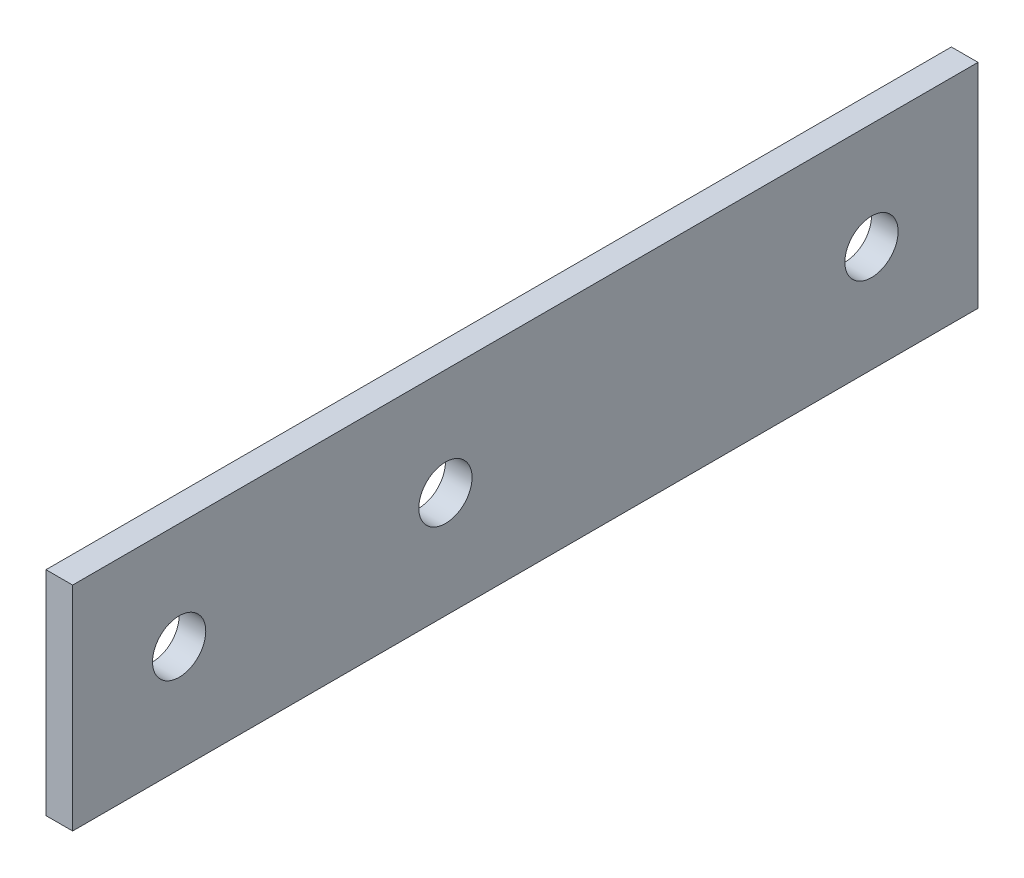
ISO-10303-21;
HEADER;
FILE_DESCRIPTION(('STEP AP214'),'2;1');
FILE_NAME('part.step','',(''),(''),'','','');
FILE_SCHEMA(('AUTOMOTIVE_DESIGN { 1 0 10303 214 1 1 1 1 }'));
ENDSEC;
DATA;
#1=APPLICATION_CONTEXT('core data for automotive mechanical design processes');
#2=APPLICATION_PROTOCOL_DEFINITION('international standard','automotive_design',2000,#1);
#3=PRODUCT_CONTEXT('',#1,'mechanical');
#4=PRODUCT('Part','Part','',(#3));
#5=PRODUCT_RELATED_PRODUCT_CATEGORY('part','',(#4));
#6=PRODUCT_DEFINITION_FORMATION('','',#4);
#7=PRODUCT_DEFINITION_CONTEXT('part definition',#1,'design');
#8=PRODUCT_DEFINITION('design','',#6,#7);
#9=PRODUCT_DEFINITION_SHAPE('','',#8);
#10=(LENGTH_UNIT() NAMED_UNIT(*) SI_UNIT(.MILLI.,.METRE.));
#11=(NAMED_UNIT(*) PLANE_ANGLE_UNIT() SI_UNIT($,.RADIAN.));
#12=(NAMED_UNIT(*) SI_UNIT($,.STERADIAN.) SOLID_ANGLE_UNIT());
#13=UNCERTAINTY_MEASURE_WITH_UNIT(LENGTH_MEASURE(1.E-05),#10,'distance_accuracy_value','');
#14=(GEOMETRIC_REPRESENTATION_CONTEXT(3) GLOBAL_UNCERTAINTY_ASSIGNED_CONTEXT((#13)) GLOBAL_UNIT_ASSIGNED_CONTEXT((#10,
#11,#12)) REPRESENTATION_CONTEXT('',''));
#15=CARTESIAN_POINT('',(0.,0.,0.));
#16=DIRECTION('',(0.,0.,1.));
#17=DIRECTION('',(1.,0.,0.));
#18=AXIS2_PLACEMENT_3D('',#15,#16,#17);
#19=CARTESIAN_POINT('',(3.175,-12.7,53.975));
#20=DIRECTION('',(0.,0.,-1.));
#21=DIRECTION('',(-1.,0.,0.));
#22=AXIS2_PLACEMENT_3D('',#19,#20,#21);
#23=PLANE('',#22);
#24=DIRECTION('',(0.,-1.,0.));
#25=VECTOR('',#24,1.);
#26=CARTESIAN_POINT('',(0.,-12.7,53.975));
#27=LINE('',#26,#25);
#28=CARTESIAN_POINT('',(0.,12.7,53.975));
#29=VERTEX_POINT('',#28);
#30=CARTESIAN_POINT('',(0.,-12.7,53.975));
#31=VERTEX_POINT('',#30);
#32=EDGE_CURVE('E96',#29,#31,#27,.T.);
#33=ORIENTED_EDGE('',*,*,#32,.T.);
#34=DIRECTION('',(-1.,0.,0.));
#35=VECTOR('',#34,1.);
#36=CARTESIAN_POINT('',(3.175,-12.7,53.975));
#37=LINE('',#36,#35);
#38=CARTESIAN_POINT('',(3.175,-12.7,53.975));
#39=VERTEX_POINT('',#38);
#40=EDGE_CURVE('E11',#39,#31,#37,.T.);
#41=ORIENTED_EDGE('',*,*,#40,.F.);
#42=DIRECTION('',(0.,-1.,0.));
#43=VECTOR('',#42,1.);
#44=CARTESIAN_POINT('',(3.175,-12.7,53.975));
#45=LINE('',#44,#43);
#46=CARTESIAN_POINT('',(3.175,12.7,53.975));
#47=VERTEX_POINT('',#46);
#48=EDGE_CURVE('E84',#47,#39,#45,.T.);
#49=ORIENTED_EDGE('',*,*,#48,.F.);
#50=DIRECTION('',(-1.,0.,0.));
#51=VECTOR('',#50,1.);
#52=CARTESIAN_POINT('',(3.175,12.7,53.975));
#53=LINE('',#52,#51);
#54=EDGE_CURVE('E92',#47,#29,#53,.T.);
#55=ORIENTED_EDGE('',*,*,#54,.T.);
#56=EDGE_LOOP('',(#33,#41,#49,#55));
#57=FACE_BOUND('',#56,.T.);
#58=ADVANCED_FACE('F33',(#57),#23,.F.);
#59=CARTESIAN_POINT('',(3.175,-12.7,-53.975));
#60=DIRECTION('',(0.,1.,0.));
#61=DIRECTION('',(0.,0.,1.));
#62=AXIS2_PLACEMENT_3D('',#59,#60,#61);
#63=PLANE('',#62);
#64=DIRECTION('',(0.,0.,-1.));
#65=VECTOR('',#64,1.);
#66=CARTESIAN_POINT('',(0.,-12.7,-53.975));
#67=LINE('',#66,#65);
#68=CARTESIAN_POINT('',(0.,-12.7,-53.975));
#69=VERTEX_POINT('',#68);
#70=EDGE_CURVE('E88',#31,#69,#67,.T.);
#71=ORIENTED_EDGE('',*,*,#70,.T.);
#72=DIRECTION('',(-1.,0.,0.));
#73=VECTOR('',#72,1.);
#74=CARTESIAN_POINT('',(3.175,-12.7,-53.975));
#75=LINE('',#74,#73);
#76=CARTESIAN_POINT('',(3.175,-12.7,-53.975));
#77=VERTEX_POINT('',#76);
#78=EDGE_CURVE('E41',#77,#69,#75,.T.);
#79=ORIENTED_EDGE('',*,*,#78,.F.);
#80=DIRECTION('',(0.,0.,-1.));
#81=VECTOR('',#80,1.);
#82=CARTESIAN_POINT('',(3.175,-12.7,-53.975));
#83=LINE('',#82,#81);
#84=EDGE_CURVE('E79',#39,#77,#83,.T.);
#85=ORIENTED_EDGE('',*,*,#84,.F.);
#86=ORIENTED_EDGE('',*,*,#40,.T.);
#87=EDGE_LOOP('',(#71,#79,#85,#86));
#88=FACE_BOUND('',#87,.T.);
#89=ADVANCED_FACE('F87',(#88),#63,.F.);
#90=CARTESIAN_POINT('',(3.175,-12.7,-53.975));
#91=DIRECTION('',(0.,0.,1.));
#92=DIRECTION('',(1.,0.,0.));
#93=AXIS2_PLACEMENT_3D('',#90,#91,#92);
#94=PLANE('',#93);
#95=DIRECTION('',(0.,1.,0.));
#96=VECTOR('',#95,1.);
#97=CARTESIAN_POINT('',(0.,-12.7,-53.975));
#98=LINE('',#97,#96);
#99=CARTESIAN_POINT('',(0.,12.7,-53.975));
#100=VERTEX_POINT('',#99);
#101=EDGE_CURVE('E66',#69,#100,#98,.T.);
#102=ORIENTED_EDGE('',*,*,#101,.T.);
#103=DIRECTION('',(-1.,0.,0.));
#104=VECTOR('',#103,1.);
#105=CARTESIAN_POINT('',(3.175,12.7,-53.975));
#106=LINE('',#105,#104);
#107=CARTESIAN_POINT('',(3.175,12.7,-53.975));
#108=VERTEX_POINT('',#107);
#109=EDGE_CURVE('E89',#108,#100,#106,.T.);
#110=ORIENTED_EDGE('',*,*,#109,.F.);
#111=DIRECTION('',(0.,1.,0.));
#112=VECTOR('',#111,1.);
#113=CARTESIAN_POINT('',(3.175,-12.7,-53.975));
#114=LINE('',#113,#112);
#115=EDGE_CURVE('E82',#77,#108,#114,.T.);
#116=ORIENTED_EDGE('',*,*,#115,.F.);
#117=ORIENTED_EDGE('',*,*,#78,.T.);
#118=EDGE_LOOP('',(#102,#110,#116,#117));
#119=FACE_BOUND('',#118,.T.);
#120=ADVANCED_FACE('F90',(#119),#94,.F.);
#121=CARTESIAN_POINT('',(3.175,12.7,-53.975));
#122=DIRECTION('',(0.,-1.,0.));
#123=DIRECTION('',(0.,0.,-1.));
#124=AXIS2_PLACEMENT_3D('',#121,#122,#123);
#125=PLANE('',#124);
#126=DIRECTION('',(0.,0.,1.));
#127=VECTOR('',#126,1.);
#128=CARTESIAN_POINT('',(0.,12.7,-53.975));
#129=LINE('',#128,#127);
#130=EDGE_CURVE('E72',#100,#29,#129,.T.);
#131=ORIENTED_EDGE('',*,*,#130,.T.);
#132=ORIENTED_EDGE('',*,*,#54,.F.);
#133=DIRECTION('',(0.,0.,1.));
#134=VECTOR('',#133,1.);
#135=CARTESIAN_POINT('',(3.175,12.7,-53.975));
#136=LINE('',#135,#134);
#137=EDGE_CURVE('E49',#108,#47,#136,.T.);
#138=ORIENTED_EDGE('',*,*,#137,.F.);
#139=ORIENTED_EDGE('',*,*,#109,.T.);
#140=EDGE_LOOP('',(#131,#132,#138,#139));
#141=FACE_BOUND('',#140,.T.);
#142=ADVANCED_FACE('F104',(#141),#125,.F.);
#143=CARTESIAN_POINT('',(3.175,0.,0.));
#144=DIRECTION('',(1.,0.,0.));
#145=DIRECTION('',(0.,0.,-1.));
#146=AXIS2_PLACEMENT_3D('',#143,#144,#145);
#147=PLANE('',#146);
#148=CARTESIAN_POINT('',(3.175,0.,9.52499999999999));
#149=DIRECTION('',(1.,0.,0.));
#150=DIRECTION('',(0.,0.,-1.));
#151=AXIS2_PLACEMENT_3D('',#148,#149,#150);
#152=CIRCLE('',#151,3.175);
#153=CARTESIAN_POINT('',(3.175,0.,6.34999999999999));
#154=VERTEX_POINT('',#153);
#155=EDGE_CURVE('E122',#154,#154,#152,.T.);
#156=ORIENTED_EDGE('',*,*,#155,.F.);
#157=EDGE_LOOP('',(#156));
#158=FACE_BOUND('',#157,.T.);
#159=CARTESIAN_POINT('',(3.175,0.,41.275));
#160=DIRECTION('',(1.,0.,0.));
#161=DIRECTION('',(0.,0.,-1.));
#162=AXIS2_PLACEMENT_3D('',#159,#160,#161);
#163=CIRCLE('',#162,3.175);
#164=CARTESIAN_POINT('',(3.175,0.,38.1));
#165=VERTEX_POINT('',#164);
#166=EDGE_CURVE('E116',#165,#165,#163,.T.);
#167=ORIENTED_EDGE('',*,*,#166,.F.);
#168=EDGE_LOOP('',(#167));
#169=FACE_BOUND('',#168,.T.);
#170=CARTESIAN_POINT('',(3.175,0.,-41.275));
#171=DIRECTION('',(1.,0.,0.));
#172=DIRECTION('',(0.,0.,-1.));
#173=AXIS2_PLACEMENT_3D('',#170,#171,#172);
#174=CIRCLE('',#173,3.175);
#175=CARTESIAN_POINT('',(3.175,0.,-44.45));
#176=VERTEX_POINT('',#175);
#177=EDGE_CURVE('E110',#176,#176,#174,.T.);
#178=ORIENTED_EDGE('',*,*,#177,.F.);
#179=EDGE_LOOP('',(#178));
#180=FACE_BOUND('',#179,.T.);
#181=ORIENTED_EDGE('',*,*,#48,.T.);
#182=ORIENTED_EDGE('',*,*,#84,.T.);
#183=ORIENTED_EDGE('',*,*,#115,.T.);
#184=ORIENTED_EDGE('',*,*,#137,.T.);
#185=EDGE_LOOP('',(#181,#182,#183,#184));
#186=FACE_BOUND('',#185,.T.);
#187=ADVANCED_FACE('F80',(#158,#169,#180,#186),#147,.T.);
#188=CARTESIAN_POINT('',(0.,0.,0.));
#189=DIRECTION('',(1.,0.,0.));
#190=DIRECTION('',(0.,0.,-1.));
#191=AXIS2_PLACEMENT_3D('',#188,#189,#190);
#192=PLANE('',#191);
#193=CARTESIAN_POINT('',(0.,0.,9.52499999999999));
#194=DIRECTION('',(1.,0.,0.));
#195=DIRECTION('',(0.,0.,-1.));
#196=AXIS2_PLACEMENT_3D('',#193,#194,#195);
#197=CIRCLE('',#196,3.175);
#198=CARTESIAN_POINT('',(0.,0.,6.34999999999999));
#199=VERTEX_POINT('',#198);
#200=EDGE_CURVE('E113',#199,#199,#197,.T.);
#201=ORIENTED_EDGE('',*,*,#200,.T.);
#202=EDGE_LOOP('',(#201));
#203=FACE_BOUND('',#202,.T.);
#204=CARTESIAN_POINT('',(0.,0.,41.275));
#205=DIRECTION('',(1.,0.,0.));
#206=DIRECTION('',(0.,0.,-1.));
#207=AXIS2_PLACEMENT_3D('',#204,#205,#206);
#208=CIRCLE('',#207,3.175);
#209=CARTESIAN_POINT('',(0.,0.,38.1));
#210=VERTEX_POINT('',#209);
#211=EDGE_CURVE('E119',#210,#210,#208,.T.);
#212=ORIENTED_EDGE('',*,*,#211,.T.);
#213=EDGE_LOOP('',(#212));
#214=FACE_BOUND('',#213,.T.);
#215=CARTESIAN_POINT('',(0.,0.,-41.275));
#216=DIRECTION('',(1.,0.,0.));
#217=DIRECTION('',(0.,0.,-1.));
#218=AXIS2_PLACEMENT_3D('',#215,#216,#217);
#219=CIRCLE('',#218,3.175);
#220=CARTESIAN_POINT('',(0.,0.,-44.45));
#221=VERTEX_POINT('',#220);
#222=EDGE_CURVE('E99',#221,#221,#219,.T.);
#223=ORIENTED_EDGE('',*,*,#222,.T.);
#224=EDGE_LOOP('',(#223));
#225=FACE_BOUND('',#224,.T.);
#226=ORIENTED_EDGE('',*,*,#32,.F.);
#227=ORIENTED_EDGE('',*,*,#130,.F.);
#228=ORIENTED_EDGE('',*,*,#101,.F.);
#229=ORIENTED_EDGE('',*,*,#70,.F.);
#230=EDGE_LOOP('',(#226,#227,#228,#229));
#231=FACE_BOUND('',#230,.T.);
#232=ADVANCED_FACE('F107',(#203,#214,#225,#231),#192,.F.);
#233=CARTESIAN_POINT('',(0.,0.,-41.275));
#234=DIRECTION('',(1.,0.,0.));
#235=DIRECTION('',(0.,0.,-1.));
#236=AXIS2_PLACEMENT_3D('',#233,#234,#235);
#237=CYLINDRICAL_SURFACE('',#236,3.175);
#238=ORIENTED_EDGE('',*,*,#222,.F.);
#239=EDGE_LOOP('',(#238));
#240=FACE_BOUND('',#239,.T.);
#241=ORIENTED_EDGE('',*,*,#177,.T.);
#242=EDGE_LOOP('',(#241));
#243=FACE_BOUND('',#242,.T.);
#244=ADVANCED_FACE('F144',(#240,#243),#237,.F.);
#245=CARTESIAN_POINT('',(0.,0.,41.275));
#246=DIRECTION('',(1.,0.,0.));
#247=DIRECTION('',(0.,0.,-1.));
#248=AXIS2_PLACEMENT_3D('',#245,#246,#247);
#249=CYLINDRICAL_SURFACE('',#248,3.175);
#250=ORIENTED_EDGE('',*,*,#211,.F.);
#251=EDGE_LOOP('',(#250));
#252=FACE_BOUND('',#251,.T.);
#253=ORIENTED_EDGE('',*,*,#166,.T.);
#254=EDGE_LOOP('',(#253));
#255=FACE_BOUND('',#254,.T.);
#256=ADVANCED_FACE('F133',(#252,#255),#249,.F.);
#257=CARTESIAN_POINT('',(0.,0.,9.52499999999999));
#258=DIRECTION('',(1.,0.,0.));
#259=DIRECTION('',(0.,0.,-1.));
#260=AXIS2_PLACEMENT_3D('',#257,#258,#259);
#261=CYLINDRICAL_SURFACE('',#260,3.175);
#262=ORIENTED_EDGE('',*,*,#200,.F.);
#263=EDGE_LOOP('',(#262));
#264=FACE_BOUND('',#263,.T.);
#265=ORIENTED_EDGE('',*,*,#155,.T.);
#266=EDGE_LOOP('',(#265));
#267=FACE_BOUND('',#266,.T.);
#268=ADVANCED_FACE('F130',(#264,#267),#261,.F.);
#269=CLOSED_SHELL('',(#58,#89,#120,#142,#187,#232,#244,#256,#268));
#270=MANIFOLD_SOLID_BREP('B2',#269);
#271=ADVANCED_BREP_SHAPE_REPRESENTATION('',(#18,#270),#14);
#272=SHAPE_DEFINITION_REPRESENTATION(#9,#271);
ENDSEC;
END-ISO-10303-21;
